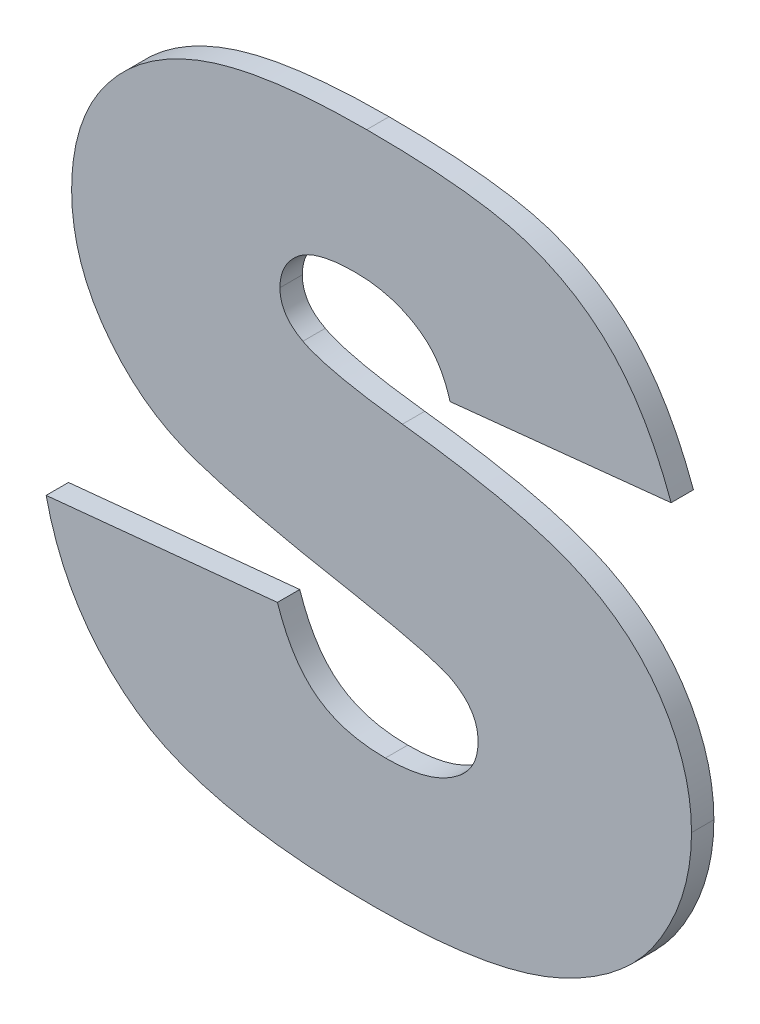
ISO-10303-21;
HEADER;
FILE_DESCRIPTION(('STEP AP214'),'2;1');
FILE_NAME('part.step','',(''),(''),'','','');
FILE_SCHEMA(('AUTOMOTIVE_DESIGN { 1 0 10303 214 1 1 1 1 }'));
ENDSEC;
DATA;
#1=APPLICATION_CONTEXT('core data for automotive mechanical design processes');
#2=APPLICATION_PROTOCOL_DEFINITION('international standard','automotive_design',2000,#1);
#3=PRODUCT_CONTEXT('',#1,'mechanical');
#4=PRODUCT('Part','Part','',(#3));
#5=PRODUCT_RELATED_PRODUCT_CATEGORY('part','',(#4));
#6=PRODUCT_DEFINITION_FORMATION('','',#4);
#7=PRODUCT_DEFINITION_CONTEXT('part definition',#1,'design');
#8=PRODUCT_DEFINITION('design','',#6,#7);
#9=PRODUCT_DEFINITION_SHAPE('','',#8);
#10=(LENGTH_UNIT() NAMED_UNIT(*) SI_UNIT(.MILLI.,.METRE.));
#11=(NAMED_UNIT(*) PLANE_ANGLE_UNIT() SI_UNIT($,.RADIAN.));
#12=(NAMED_UNIT(*) SI_UNIT($,.STERADIAN.) SOLID_ANGLE_UNIT());
#13=UNCERTAINTY_MEASURE_WITH_UNIT(LENGTH_MEASURE(1.E-05),#10,'distance_accuracy_value','');
#14=(GEOMETRIC_REPRESENTATION_CONTEXT(3) GLOBAL_UNCERTAINTY_ASSIGNED_CONTEXT((#13)) GLOBAL_UNIT_ASSIGNED_CONTEXT((#10,
#11,#12)) REPRESENTATION_CONTEXT('',''));
#15=CARTESIAN_POINT('',(0.,0.,0.));
#16=DIRECTION('',(0.,0.,1.));
#17=DIRECTION('',(1.,0.,0.));
#18=AXIS2_PLACEMENT_3D('',#15,#16,#17);
#19=CARTESIAN_POINT('',(1.4082386184724,-0.657639850114445,0.));
#20=CARTESIAN_POINT('',(1.4082386184724,-0.657639850114445,0.003));
#21=CARTESIAN_POINT('',(1.4051576482176,-0.64919573373164,0.));
#22=CARTESIAN_POINT('',(1.4051576482176,-0.64919573373164,0.003));
#23=CARTESIAN_POINT('',(1.3959147518425,-0.639382306428921,0.));
#24=CARTESIAN_POINT('',(1.3959147518425,-0.639382306428921,0.003));
#25=CARTESIAN_POINT('',(1.3819933617311,-0.634703820839705,0.));
#26=CARTESIAN_POINT('',(1.3819933617311,-0.634703820839705,0.003));
#27=CARTESIAN_POINT('',(1.3673873389081,-0.634703796504277,0.));
#28=CARTESIAN_POINT('',(1.3673873389081,-0.634703796504277,0.003));
#29=B_SPLINE_SURFACE_WITH_KNOTS('',2,1,((#19,#20),(#21,#22),(#23,#24),(#25,#26),(#27,#28)),
.UNSPECIFIED.,.F.,.F.,.F.,(3,1,1,3),(2,2),(-3.,-2.,-1.,0.),(0.,0.0003),.UNSPECIFIED.);
#30=CARTESIAN_POINT('',(1.4082386184724,-0.657639850114445,0.));
#31=CARTESIAN_POINT('',(1.4051576482176,-0.64919573373164,0.));
#32=CARTESIAN_POINT('',(1.3959147518425,-0.639382306428921,0.));
#33=CARTESIAN_POINT('',(1.3819933617311,-0.634703820839705,0.));
#34=CARTESIAN_POINT('',(1.3673873389081,-0.634703796504277,0.));
#35=B_SPLINE_CURVE_WITH_KNOTS('',2,(#30,#31,#32,#33,#34),.UNSPECIFIED.,.F.,.F.,(3,1,1,3),(-3.,
-2.,-1.,0.),.UNSPECIFIED.);
#36=CARTESIAN_POINT('',(1.4082386184724,-0.657639850114445,0.));
#37=VERTEX_POINT('',#36);
#38=CARTESIAN_POINT('',(1.3673873389081,-0.634703796504277,0.));
#39=VERTEX_POINT('',#38);
#40=EDGE_CURVE('E11',#37,#39,#35,.T.);
#41=DIRECTION('',(0.,0.,1.));
#42=VECTOR('',#41,1.);
#43=CARTESIAN_POINT('',(1.3673873389081,-0.634703796504277,0.));
#44=LINE('',#43,#42);
#45=CARTESIAN_POINT('',(1.3673873389081,-0.634703796504277,0.003));
#46=VERTEX_POINT('',#45);
#47=EDGE_CURVE('E28',#39,#46,#44,.T.);
#48=CARTESIAN_POINT('',(1.4082386184724,-0.657639850114445,0.003));
#49=CARTESIAN_POINT('',(1.4051576482176,-0.64919573373164,0.003));
#50=CARTESIAN_POINT('',(1.3959147518425,-0.639382306428921,0.003));
#51=CARTESIAN_POINT('',(1.3819933617311,-0.634703820839705,0.003));
#52=CARTESIAN_POINT('',(1.3673873389081,-0.634703796504277,0.003));
#53=B_SPLINE_CURVE_WITH_KNOTS('',2,(#48,#49,#50,#51,#52),.UNSPECIFIED.,.F.,.F.,(3,1,1,3),(-3.,
-2.,-1.,0.),.UNSPECIFIED.);
#54=CARTESIAN_POINT('',(1.4082386184724,-0.657639850114445,0.003));
#55=VERTEX_POINT('',#54);
#56=EDGE_CURVE('E164',#55,#46,#53,.T.);
#57=DIRECTION('',(0.,0.,1.));
#58=VECTOR('',#57,1.);
#59=CARTESIAN_POINT('',(1.4082386184724,-0.657639850114445,0.));
#60=LINE('',#59,#58);
#61=EDGE_CURVE('E450',#37,#55,#60,.T.);
#62=ORIENTED_EDGE('',*,*,#40,.T.);
#63=ORIENTED_EDGE('',*,*,#47,.T.);
#64=ORIENTED_EDGE('',*,*,#56,.F.);
#65=ORIENTED_EDGE('',*,*,#61,.F.);
#66=EDGE_LOOP('',(#62,#63,#64,#65));
#67=FACE_BOUND('',#66,.T.);
#68=ADVANCED_FACE('F17',(#67),#29,.T.);
#69=CARTESIAN_POINT('',(1.3785700914145,-0.660720812539698,0.));
#70=DIRECTION('',(0.103290702639445,-0.994651210600103,0.));
#71=DIRECTION('',(0.994651210600103,0.103290702639445,0.));
#72=AXIS2_PLACEMENT_3D('',#69,#70,#71);
#73=PLANE('',#72);
#74=DIRECTION('',(0.994651210600103,0.103290702639445,0.));
#75=VECTOR('',#74,1.);
#76=CARTESIAN_POINT('',(1.3785700914145,-0.660720812539698,0.));
#77=LINE('',#76,#75);
#78=CARTESIAN_POINT('',(1.3785700914145,-0.660720812539698,0.));
#79=VERTEX_POINT('',#78);
#80=EDGE_CURVE('E447',#79,#37,#77,.T.);
#81=ORIENTED_EDGE('',*,*,#80,.T.);
#82=ORIENTED_EDGE('',*,*,#61,.T.);
#83=DIRECTION('',(0.994651210600103,0.103290702639445,0.));
#84=VECTOR('',#83,1.);
#85=CARTESIAN_POINT('',(1.3785700914145,-0.660720812539698,0.003));
#86=LINE('',#85,#84);
#87=CARTESIAN_POINT('',(1.3785700914145,-0.660720812539698,0.003));
#88=VERTEX_POINT('',#87);
#89=EDGE_CURVE('E445',#88,#55,#86,.T.);
#90=ORIENTED_EDGE('',*,*,#89,.F.);
#91=DIRECTION('',(0.,0.,1.));
#92=VECTOR('',#91,1.);
#93=CARTESIAN_POINT('',(1.3785700914145,-0.660720812539698,0.));
#94=LINE('',#93,#92);
#95=EDGE_CURVE('E439',#79,#88,#94,.T.);
#96=ORIENTED_EDGE('',*,*,#95,.F.);
#97=EDGE_LOOP('',(#81,#82,#90,#96));
#98=FACE_BOUND('',#97,.T.);
#99=ADVANCED_FACE('F502',(#98),#73,.T.);
#100=CARTESIAN_POINT('',(1.3746903609531,-0.654672997408655,0.));
#101=CARTESIAN_POINT('',(1.3746903609531,-0.654672997408655,0.003));
#102=CARTESIAN_POINT('',(1.3774289942489,-0.656612862598566,0.));
#103=CARTESIAN_POINT('',(1.3774289942489,-0.656612862598566,0.003));
#104=CARTESIAN_POINT('',(1.3785700914145,-0.660720812539698,0.));
#105=CARTESIAN_POINT('',(1.3785700914145,-0.660720812539698,0.003));
#106=B_SPLINE_SURFACE_WITH_KNOTS('',2,1,((#100,#101),(#102,#103),(#104,#105)),.UNSPECIFIED.,.F.,
.F.,.F.,(3,3),(2,2),(-1.,0.),(0.,0.0003),.UNSPECIFIED.);
#107=CARTESIAN_POINT('',(1.3746903609531,-0.654672997408655,0.));
#108=CARTESIAN_POINT('',(1.3774289942489,-0.656612862598566,0.));
#109=CARTESIAN_POINT('',(1.3785700914145,-0.660720812539698,0.));
#110=B_SPLINE_CURVE_WITH_KNOTS('',2,(#107,#108,#109),.UNSPECIFIED.,.F.,.F.,(3,3),(-1.,0.),.UNSPECIFIED.);
#111=CARTESIAN_POINT('',(1.3746903609531,-0.654672997408655,0.));
#112=VERTEX_POINT('',#111);
#113=EDGE_CURVE('E431',#112,#79,#110,.T.);
#114=CARTESIAN_POINT('',(1.3746903609531,-0.654672997408655,0.003));
#115=CARTESIAN_POINT('',(1.3774289942489,-0.656612862598566,0.003));
#116=CARTESIAN_POINT('',(1.3785700914145,-0.660720812539698,0.003));
#117=B_SPLINE_CURVE_WITH_KNOTS('',2,(#114,#115,#116),.UNSPECIFIED.,.F.,.F.,(3,3),(-1.,0.),.UNSPECIFIED.);
#118=CARTESIAN_POINT('',(1.3746903609531,-0.654672997408655,0.003));
#119=VERTEX_POINT('',#118);
#120=EDGE_CURVE('E426',#119,#88,#117,.T.);
#121=DIRECTION('',(0.,0.,1.));
#122=VECTOR('',#121,1.);
#123=CARTESIAN_POINT('',(1.3746903609531,-0.654672997408655,0.));
#124=LINE('',#123,#122);
#125=EDGE_CURVE('E420',#112,#119,#124,.T.);
#126=ORIENTED_EDGE('',*,*,#113,.T.);
#127=ORIENTED_EDGE('',*,*,#95,.T.);
#128=ORIENTED_EDGE('',*,*,#120,.F.);
#129=ORIENTED_EDGE('',*,*,#125,.F.);
#130=EDGE_LOOP('',(#126,#127,#128,#129));
#131=FACE_BOUND('',#130,.T.);
#132=ADVANCED_FACE('F499',(#131),#106,.T.);
#133=CARTESIAN_POINT('',(1.3659039125552,-0.652048473861224,0.));
#134=CARTESIAN_POINT('',(1.3659039125552,-0.652048473861224,0.003));
#135=CARTESIAN_POINT('',(1.3710388499305,-0.652048450704146,0.));
#136=CARTESIAN_POINT('',(1.3710388499305,-0.652048450704146,0.003));
#137=CARTESIAN_POINT('',(1.3746903609531,-0.654672997408655,0.));
#138=CARTESIAN_POINT('',(1.3746903609531,-0.654672997408655,0.003));
#139=B_SPLINE_SURFACE_WITH_KNOTS('',2,1,((#133,#134),(#135,#136),(#137,#138)),.UNSPECIFIED.,.F.,
.F.,.F.,(3,3),(2,2),(-1.,0.),(0.,0.0003),.UNSPECIFIED.);
#140=CARTESIAN_POINT('',(1.3659039125552,-0.652048473861224,0.));
#141=CARTESIAN_POINT('',(1.3710388499305,-0.652048450704146,0.));
#142=CARTESIAN_POINT('',(1.3746903609531,-0.654672997408655,0.));
#143=B_SPLINE_CURVE_WITH_KNOTS('',2,(#140,#141,#142),.UNSPECIFIED.,.F.,.F.,(3,3),(-1.,0.),.UNSPECIFIED.);
#144=CARTESIAN_POINT('',(1.3659039125552,-0.652048473861224,0.));
#145=VERTEX_POINT('',#144);
#146=EDGE_CURVE('E412',#145,#112,#143,.T.);
#147=CARTESIAN_POINT('',(1.3659039125552,-0.652048473861224,0.003));
#148=CARTESIAN_POINT('',(1.3710388499305,-0.652048450704146,0.003));
#149=CARTESIAN_POINT('',(1.3746903609531,-0.654672997408655,0.003));
#150=B_SPLINE_CURVE_WITH_KNOTS('',2,(#147,#148,#149),.UNSPECIFIED.,.F.,.F.,(3,3),(-1.,0.),.UNSPECIFIED.);
#151=CARTESIAN_POINT('',(1.3659039125552,-0.652048473861224,0.003));
#152=VERTEX_POINT('',#151);
#153=EDGE_CURVE('E407',#152,#119,#150,.T.);
#154=DIRECTION('',(0.,0.,1.));
#155=VECTOR('',#154,1.);
#156=CARTESIAN_POINT('',(1.3659039125552,-0.652048473861224,0.));
#157=LINE('',#156,#155);
#158=EDGE_CURVE('E401',#145,#152,#157,.T.);
#159=ORIENTED_EDGE('',*,*,#146,.T.);
#160=ORIENTED_EDGE('',*,*,#125,.T.);
#161=ORIENTED_EDGE('',*,*,#153,.F.);
#162=ORIENTED_EDGE('',*,*,#158,.F.);
#163=EDGE_LOOP('',(#159,#160,#161,#162));
#164=FACE_BOUND('',#163,.T.);
#165=ADVANCED_FACE('F496',(#164),#139,.T.);
#166=CARTESIAN_POINT('',(1.3557481475238,-0.65889505702844,0.));
#167=CARTESIAN_POINT('',(1.3557481475238,-0.65889505702844,0.003));
#168=CARTESIAN_POINT('',(1.3557481369992,-0.656042314042115,0.));
#169=CARTESIAN_POINT('',(1.3557481369992,-0.656042314042115,0.003));
#170=CARTESIAN_POINT('',(1.3605407304816,-0.652048456179835,0.));
#171=CARTESIAN_POINT('',(1.3605407304816,-0.652048456179835,0.003));
#172=CARTESIAN_POINT('',(1.3659039125552,-0.652048473861224,0.));
#173=CARTESIAN_POINT('',(1.3659039125552,-0.652048473861224,0.003));
#174=B_SPLINE_SURFACE_WITH_KNOTS('',2,1,((#166,#167),(#168,#169),(#170,#171),(#172,#173)),
.UNSPECIFIED.,.F.,.F.,.F.,(3,1,3),(2,2),(-2.,-1.,0.),(0.,0.0003),.UNSPECIFIED.);
#175=CARTESIAN_POINT('',(1.3557481475238,-0.65889505702844,0.));
#176=CARTESIAN_POINT('',(1.3557481369992,-0.656042314042115,0.));
#177=CARTESIAN_POINT('',(1.3605407304816,-0.652048456179835,0.));
#178=CARTESIAN_POINT('',(1.3659039125552,-0.652048473861224,0.));
#179=B_SPLINE_CURVE_WITH_KNOTS('',2,(#175,#176,#177,#178),.UNSPECIFIED.,.F.,.F.,(3,1,3),(-2.,
-1.,0.),.UNSPECIFIED.);
#180=CARTESIAN_POINT('',(1.3557481475238,-0.65889505702844,0.));
#181=VERTEX_POINT('',#180);
#182=EDGE_CURVE('E393',#181,#145,#179,.T.);
#183=CARTESIAN_POINT('',(1.3557481475238,-0.65889505702844,0.003));
#184=CARTESIAN_POINT('',(1.3557481369992,-0.656042314042115,0.003));
#185=CARTESIAN_POINT('',(1.3605407304816,-0.652048456179835,0.003));
#186=CARTESIAN_POINT('',(1.3659039125552,-0.652048473861224,0.003));
#187=B_SPLINE_CURVE_WITH_KNOTS('',2,(#183,#184,#185,#186),.UNSPECIFIED.,.F.,.F.,(3,1,3),(-2.,
-1.,0.),.UNSPECIFIED.);
#188=CARTESIAN_POINT('',(1.3557481475238,-0.65889505702844,0.003));
#189=VERTEX_POINT('',#188);
#190=EDGE_CURVE('E388',#189,#152,#187,.T.);
#191=DIRECTION('',(0.,0.,1.));
#192=VECTOR('',#191,1.);
#193=CARTESIAN_POINT('',(1.3557481475238,-0.65889505702844,0.));
#194=LINE('',#193,#192);
#195=EDGE_CURVE('E382',#181,#189,#194,.T.);
#196=ORIENTED_EDGE('',*,*,#182,.T.);
#197=ORIENTED_EDGE('',*,*,#158,.T.);
#198=ORIENTED_EDGE('',*,*,#190,.F.);
#199=ORIENTED_EDGE('',*,*,#195,.F.);
#200=EDGE_LOOP('',(#196,#197,#198,#199));
#201=FACE_BOUND('',#200,.T.);
#202=ADVANCED_FACE('F493',(#201),#174,.T.);
#203=CARTESIAN_POINT('',(1.358829109949,-0.663573555526033,0.));
#204=CARTESIAN_POINT('',(1.358829109949,-0.663573555526033,0.003));
#205=CARTESIAN_POINT('',(1.3557481435751,-0.661976027069107,0.));
#206=CARTESIAN_POINT('',(1.3557481435751,-0.661976027069107,0.003));
#207=CARTESIAN_POINT('',(1.3557481475238,-0.65889505702844,0.));
#208=CARTESIAN_POINT('',(1.3557481475238,-0.65889505702844,0.003));
#209=B_SPLINE_SURFACE_WITH_KNOTS('',2,1,((#203,#204),(#205,#206),(#207,#208)),.UNSPECIFIED.,.F.,
.F.,.F.,(3,3),(2,2),(-1.,0.),(0.,0.0003),.UNSPECIFIED.);
#210=CARTESIAN_POINT('',(1.358829109949,-0.663573555526033,0.));
#211=CARTESIAN_POINT('',(1.3557481435751,-0.661976027069107,0.));
#212=CARTESIAN_POINT('',(1.3557481475238,-0.65889505702844,0.));
#213=B_SPLINE_CURVE_WITH_KNOTS('',2,(#210,#211,#212),.UNSPECIFIED.,.F.,.F.,(3,3),(-1.,0.),.UNSPECIFIED.);
#214=CARTESIAN_POINT('',(1.358829109949,-0.663573555526033,0.));
#215=VERTEX_POINT('',#214);
#216=EDGE_CURVE('E374',#215,#181,#213,.T.);
#217=CARTESIAN_POINT('',(1.358829109949,-0.663573555526033,0.003));
#218=CARTESIAN_POINT('',(1.3557481435751,-0.661976027069107,0.003));
#219=CARTESIAN_POINT('',(1.3557481475238,-0.65889505702844,0.003));
#220=B_SPLINE_CURVE_WITH_KNOTS('',2,(#217,#218,#219),.UNSPECIFIED.,.F.,.F.,(3,3),(-1.,0.),.UNSPECIFIED.);
#221=CARTESIAN_POINT('',(1.358829109949,-0.663573555526033,0.003));
#222=VERTEX_POINT('',#221);
#223=EDGE_CURVE('E369',#222,#189,#220,.T.);
#224=DIRECTION('',(0.,0.,1.));
#225=VECTOR('',#224,1.);
#226=CARTESIAN_POINT('',(1.358829109949,-0.663573555526033,0.));
#227=LINE('',#226,#225);
#228=EDGE_CURVE('E363',#215,#222,#227,.T.);
#229=ORIENTED_EDGE('',*,*,#216,.T.);
#230=ORIENTED_EDGE('',*,*,#195,.T.);
#231=ORIENTED_EDGE('',*,*,#223,.F.);
#232=ORIENTED_EDGE('',*,*,#228,.F.);
#233=EDGE_LOOP('',(#229,#230,#231,#232));
#234=FACE_BOUND('',#233,.T.);
#235=ADVANCED_FACE('F490',(#234),#209,.T.);
#236=CARTESIAN_POINT('',(1.3721799471251,-0.66654040823183,0.));
#237=CARTESIAN_POINT('',(1.3721799471251,-0.66654040823183,0.003));
#238=CARTESIAN_POINT('',(1.3619100710089,-0.665285212489224,0.));
#239=CARTESIAN_POINT('',(1.3619100710089,-0.665285212489224,0.003));
#240=CARTESIAN_POINT('',(1.358829109949,-0.663573555526033,0.));
#241=CARTESIAN_POINT('',(1.358829109949,-0.663573555526033,0.003));
#242=B_SPLINE_SURFACE_WITH_KNOTS('',2,1,((#236,#237),(#238,#239),(#240,#241)),.UNSPECIFIED.,.F.,
.F.,.F.,(3,3),(2,2),(-1.,0.),(0.,0.0003),.UNSPECIFIED.);
#243=CARTESIAN_POINT('',(1.3721799471251,-0.66654040823183,0.));
#244=CARTESIAN_POINT('',(1.3619100710089,-0.665285212489224,0.));
#245=CARTESIAN_POINT('',(1.358829109949,-0.663573555526033,0.));
#246=B_SPLINE_CURVE_WITH_KNOTS('',2,(#243,#244,#245),.UNSPECIFIED.,.F.,.F.,(3,3),(-1.,0.),.UNSPECIFIED.);
#247=CARTESIAN_POINT('',(1.3721799471251,-0.66654040823183,0.));
#248=VERTEX_POINT('',#247);
#249=EDGE_CURVE('E355',#248,#215,#246,.T.);
#250=CARTESIAN_POINT('',(1.3721799471251,-0.66654040823183,0.003));
#251=CARTESIAN_POINT('',(1.3619100710089,-0.665285212489224,0.003));
#252=CARTESIAN_POINT('',(1.358829109949,-0.663573555526033,0.003));
#253=B_SPLINE_CURVE_WITH_KNOTS('',2,(#250,#251,#252),.UNSPECIFIED.,.F.,.F.,(3,3),(-1.,0.),.UNSPECIFIED.);
#254=CARTESIAN_POINT('',(1.3721799471251,-0.66654040823183,0.003));
#255=VERTEX_POINT('',#254);
#256=EDGE_CURVE('E350',#255,#222,#253,.T.);
#257=DIRECTION('',(0.,0.,1.));
#258=VECTOR('',#257,1.);
#259=CARTESIAN_POINT('',(1.3721799471251,-0.66654040823183,0.));
#260=LINE('',#259,#258);
#261=EDGE_CURVE('E344',#248,#255,#260,.T.);
#262=ORIENTED_EDGE('',*,*,#249,.T.);
#263=ORIENTED_EDGE('',*,*,#228,.T.);
#264=ORIENTED_EDGE('',*,*,#256,.F.);
#265=ORIENTED_EDGE('',*,*,#261,.F.);
#266=EDGE_LOOP('',(#262,#263,#264,#265));
#267=FACE_BOUND('',#266,.T.);
#268=ADVANCED_FACE('F487',(#267),#242,.T.);
#269=CARTESIAN_POINT('',(1.4109772517393,-0.694611399217406,0.));
#270=CARTESIAN_POINT('',(1.4109772517393,-0.694611399217406,0.003));
#271=CARTESIAN_POINT('',(1.4109772428158,-0.687308377172382,0.));
#272=CARTESIAN_POINT('',(1.4109772428158,-0.687308377172382,0.003));
#273=CARTESIAN_POINT('',(1.4028754376761,-0.674984537370917,0.));
#274=CARTESIAN_POINT('',(1.4028754376761,-0.674984537370917,0.003));
#275=CARTESIAN_POINT('',(1.3876988369019,-0.668366192186816,0.));
#276=CARTESIAN_POINT('',(1.3876988369019,-0.668366192186816,0.003));
#277=CARTESIAN_POINT('',(1.3721799471251,-0.66654040823183,0.));
#278=CARTESIAN_POINT('',(1.3721799471251,-0.66654040823183,0.003));
#279=B_SPLINE_SURFACE_WITH_KNOTS('',2,1,((#269,#270),(#271,#272),(#273,#274),(#275,#276),(#277,
#278)),.UNSPECIFIED.,.F.,.F.,.F.,(3,1,1,3),(2,2),(-3.,-2.,-1.,0.),(0.,0.0003),.UNSPECIFIED.);
#280=CARTESIAN_POINT('',(1.4109772517393,-0.694611399217406,0.));
#281=CARTESIAN_POINT('',(1.4109772428158,-0.687308377172382,0.));
#282=CARTESIAN_POINT('',(1.4028754376761,-0.674984537370917,0.));
#283=CARTESIAN_POINT('',(1.3876988369019,-0.668366192186816,0.));
#284=CARTESIAN_POINT('',(1.3721799471251,-0.66654040823183,0.));
#285=B_SPLINE_CURVE_WITH_KNOTS('',2,(#280,#281,#282,#283,#284),.UNSPECIFIED.,.F.,.F.,(3,1,1,3),
(-3.,-2.,-1.,0.),.UNSPECIFIED.);
#286=CARTESIAN_POINT('',(1.4109772517393,-0.694611399217406,0.));
#287=VERTEX_POINT('',#286);
#288=EDGE_CURVE('E336',#287,#248,#285,.T.);
#289=CARTESIAN_POINT('',(1.4109772517393,-0.694611399217406,0.003));
#290=CARTESIAN_POINT('',(1.4109772428158,-0.687308377172382,0.003));
#291=CARTESIAN_POINT('',(1.4028754376761,-0.674984537370917,0.003));
#292=CARTESIAN_POINT('',(1.3876988369019,-0.668366192186816,0.003));
#293=CARTESIAN_POINT('',(1.3721799471251,-0.66654040823183,0.003));
#294=B_SPLINE_CURVE_WITH_KNOTS('',2,(#289,#290,#291,#292,#293),.UNSPECIFIED.,.F.,.F.,(3,1,1,3),
(-3.,-2.,-1.,0.),.UNSPECIFIED.);
#295=CARTESIAN_POINT('',(1.4109772517393,-0.694611399217406,0.003));
#296=VERTEX_POINT('',#295);
#297=EDGE_CURVE('E331',#296,#255,#294,.T.);
#298=DIRECTION('',(0.,0.,1.));
#299=VECTOR('',#298,1.);
#300=CARTESIAN_POINT('',(1.4109772517393,-0.694611399217406,0.));
#301=LINE('',#300,#299);
#302=EDGE_CURVE('E325',#287,#296,#301,.T.);
#303=ORIENTED_EDGE('',*,*,#288,.T.);
#304=ORIENTED_EDGE('',*,*,#261,.T.);
#305=ORIENTED_EDGE('',*,*,#297,.F.);
#306=ORIENTED_EDGE('',*,*,#302,.F.);
#307=EDGE_LOOP('',(#303,#304,#305,#306));
#308=FACE_BOUND('',#307,.T.);
#309=ADVANCED_FACE('F484',(#308),#279,.T.);
#310=CARTESIAN_POINT('',(1.3683002166637,-0.724508145714247,0.));
#311=CARTESIAN_POINT('',(1.3683002166637,-0.724508145714247,0.003));
#312=CARTESIAN_POINT('',(1.3841614676677,-0.72450814547791,0.));
#313=CARTESIAN_POINT('',(1.3841614676677,-0.72450814547791,0.003));
#314=CARTESIAN_POINT('',(1.4024190226562,-0.716178135685756,0.));
#315=CARTESIAN_POINT('',(1.4024190226562,-0.716178135685756,0.003));
#316=CARTESIAN_POINT('',(1.4109772514061,-0.702142640065437,0.));
#317=CARTESIAN_POINT('',(1.4109772514061,-0.702142640065437,0.003));
#318=CARTESIAN_POINT('',(1.4109772517393,-0.694611399217406,0.));
#319=CARTESIAN_POINT('',(1.4109772517393,-0.694611399217406,0.003));
#320=B_SPLINE_SURFACE_WITH_KNOTS('',2,1,((#310,#311),(#312,#313),(#314,#315),(#316,#317),(#318,
#319)),.UNSPECIFIED.,.F.,.F.,.F.,(3,1,1,3),(2,2),(-3.,-2.,-1.,0.),(0.,0.0003),.UNSPECIFIED.);
#321=CARTESIAN_POINT('',(1.3683002166637,-0.724508145714247,0.));
#322=CARTESIAN_POINT('',(1.3841614676677,-0.72450814547791,0.));
#323=CARTESIAN_POINT('',(1.4024190226562,-0.716178135685756,0.));
#324=CARTESIAN_POINT('',(1.4109772514061,-0.702142640065437,0.));
#325=CARTESIAN_POINT('',(1.4109772517393,-0.694611399217406,0.));
#326=B_SPLINE_CURVE_WITH_KNOTS('',2,(#321,#322,#323,#324,#325),.UNSPECIFIED.,.F.,.F.,(3,1,1,3),
(-3.,-2.,-1.,0.),.UNSPECIFIED.);
#327=CARTESIAN_POINT('',(1.3683002166637,-0.724508145714247,0.));
#328=VERTEX_POINT('',#327);
#329=EDGE_CURVE('E317',#328,#287,#326,.T.);
#330=CARTESIAN_POINT('',(1.3683002166637,-0.724508145714247,0.003));
#331=CARTESIAN_POINT('',(1.3841614676677,-0.72450814547791,0.003));
#332=CARTESIAN_POINT('',(1.4024190226562,-0.716178135685756,0.003));
#333=CARTESIAN_POINT('',(1.4109772514061,-0.702142640065437,0.003));
#334=CARTESIAN_POINT('',(1.4109772517393,-0.694611399217406,0.003));
#335=B_SPLINE_CURVE_WITH_KNOTS('',2,(#330,#331,#332,#333,#334),.UNSPECIFIED.,.F.,.F.,(3,1,1,3),
(-3.,-2.,-1.,0.),.UNSPECIFIED.);
#336=CARTESIAN_POINT('',(1.3683002166637,-0.724508145714247,0.003));
#337=VERTEX_POINT('',#336);
#338=EDGE_CURVE('E312',#337,#296,#335,.T.);
#339=DIRECTION('',(0.,0.,1.));
#340=VECTOR('',#339,1.);
#341=CARTESIAN_POINT('',(1.3683002166637,-0.724508145714247,0.));
#342=LINE('',#341,#340);
#343=EDGE_CURVE('E306',#328,#337,#342,.T.);
#344=ORIENTED_EDGE('',*,*,#329,.T.);
#345=ORIENTED_EDGE('',*,*,#302,.T.);
#346=ORIENTED_EDGE('',*,*,#338,.F.);
#347=ORIENTED_EDGE('',*,*,#343,.F.);
#348=EDGE_LOOP('',(#344,#345,#346,#347));
#349=FACE_BOUND('',#348,.T.);
#350=ADVANCED_FACE('F481',(#349),#320,.T.);
#351=CARTESIAN_POINT('',(1.3243679746741,-0.698719349117736,0.));
#352=CARTESIAN_POINT('',(1.3243679746741,-0.698719349117736,0.003));
#353=CARTESIAN_POINT('',(1.3271066226321,-0.711043195554043,0.));
#354=CARTESIAN_POINT('',(1.3271066226321,-0.711043195554043,0.003));
#355=CARTESIAN_POINT('',(1.3460488521128,-0.724508119868673,0.));
#356=CARTESIAN_POINT('',(1.3460488521128,-0.724508119868673,0.003));
#357=CARTESIAN_POINT('',(1.3683002166637,-0.724508145714247,0.));
#358=CARTESIAN_POINT('',(1.3683002166637,-0.724508145714247,0.003));
#359=B_SPLINE_SURFACE_WITH_KNOTS('',2,1,((#351,#352),(#353,#354),(#355,#356),(#357,#358)),
.UNSPECIFIED.,.F.,.F.,.F.,(3,1,3),(2,2),(-2.,-1.,0.),(0.,0.0003),.UNSPECIFIED.);
#360=CARTESIAN_POINT('',(1.3243679746741,-0.698719349117736,0.));
#361=CARTESIAN_POINT('',(1.3271066226321,-0.711043195554043,0.));
#362=CARTESIAN_POINT('',(1.3460488521128,-0.724508119868673,0.));
#363=CARTESIAN_POINT('',(1.3683002166637,-0.724508145714247,0.));
#364=B_SPLINE_CURVE_WITH_KNOTS('',2,(#360,#361,#362,#363),.UNSPECIFIED.,.F.,.F.,(3,1,3),(-2.,
-1.,0.),.UNSPECIFIED.);
#365=CARTESIAN_POINT('',(1.3243679746741,-0.698719349117736,0.));
#366=VERTEX_POINT('',#365);
#367=EDGE_CURVE('E298',#366,#328,#364,.T.);
#368=CARTESIAN_POINT('',(1.3243679746741,-0.698719349117736,0.003));
#369=CARTESIAN_POINT('',(1.3271066226321,-0.711043195554043,0.003));
#370=CARTESIAN_POINT('',(1.3460488521128,-0.724508119868673,0.003));
#371=CARTESIAN_POINT('',(1.3683002166637,-0.724508145714247,0.003));
#372=B_SPLINE_CURVE_WITH_KNOTS('',2,(#368,#369,#370,#371),.UNSPECIFIED.,.F.,.F.,(3,1,3),(-2.,
-1.,0.),.UNSPECIFIED.);
#373=CARTESIAN_POINT('',(1.3243679746741,-0.698719349117736,0.003));
#374=VERTEX_POINT('',#373);
#375=EDGE_CURVE('E293',#374,#337,#372,.T.);
#376=DIRECTION('',(0.,0.,1.));
#377=VECTOR('',#376,1.);
#378=CARTESIAN_POINT('',(1.3243679746741,-0.698719349117736,0.));
#379=LINE('',#378,#377);
#380=EDGE_CURVE('E290',#366,#374,#379,.T.);
#381=ORIENTED_EDGE('',*,*,#367,.T.);
#382=ORIENTED_EDGE('',*,*,#343,.T.);
#383=ORIENTED_EDGE('',*,*,#375,.F.);
#384=ORIENTED_EDGE('',*,*,#380,.F.);
#385=EDGE_LOOP('',(#381,#382,#383,#384));
#386=FACE_BOUND('',#385,.T.);
#387=ADVANCED_FACE('F478',(#386),#359,.T.);
#388=CARTESIAN_POINT('',(1.3554058183654,-0.69563838669249,0.));
#389=DIRECTION('',(-0.0987792391162036,0.995109371837902,0.));
#390=DIRECTION('',(-0.995109371837902,-0.0987792391162036,0.));
#391=AXIS2_PLACEMENT_3D('',#388,#389,#390);
#392=PLANE('',#391);
#393=DIRECTION('',(-0.995109371837902,-0.0987792391162036,0.));
#394=VECTOR('',#393,1.);
#395=CARTESIAN_POINT('',(1.3554058183654,-0.69563838669249,0.));
#396=LINE('',#395,#394);
#397=CARTESIAN_POINT('',(1.3554058183654,-0.69563838669249,0.));
#398=VERTEX_POINT('',#397);
#399=EDGE_CURVE('E287',#398,#366,#396,.T.);
#400=ORIENTED_EDGE('',*,*,#399,.T.);
#401=ORIENTED_EDGE('',*,*,#380,.T.);
#402=DIRECTION('',(-0.995109371837902,-0.0987792391162036,0.));
#403=VECTOR('',#402,1.);
#404=CARTESIAN_POINT('',(1.3554058183654,-0.69563838669249,0.003));
#405=LINE('',#404,#403);
#406=CARTESIAN_POINT('',(1.3554058183654,-0.69563838669249,0.003));
#407=VERTEX_POINT('',#406);
#408=EDGE_CURVE('E284',#407,#374,#405,.T.);
#409=ORIENTED_EDGE('',*,*,#408,.F.);
#410=DIRECTION('',(0.,0.,1.));
#411=VECTOR('',#410,1.);
#412=CARTESIAN_POINT('',(1.3554058183654,-0.69563838669249,0.));
#413=LINE('',#412,#411);
#414=EDGE_CURVE('E278',#398,#407,#413,.T.);
#415=ORIENTED_EDGE('',*,*,#414,.F.);
#416=EDGE_LOOP('',(#400,#401,#409,#415));
#417=FACE_BOUND('',#416,.T.);
#418=ADVANCED_FACE('F475',(#417),#392,.T.);
#419=CARTESIAN_POINT('',(1.369897752736,-0.706478810040581,0.));
#420=CARTESIAN_POINT('',(1.369897752736,-0.706478810040581,0.003));
#421=CARTESIAN_POINT('',(1.3641922667633,-0.706478816842037,0.));
#422=CARTESIAN_POINT('',(1.3641922667633,-0.706478816842037,0.003));
#423=CARTESIAN_POINT('',(1.3573456776109,-0.701457997347848,0.));
#424=CARTESIAN_POINT('',(1.3573456776109,-0.701457997347848,0.003));
#425=CARTESIAN_POINT('',(1.3554058183654,-0.69563838669249,0.));
#426=CARTESIAN_POINT('',(1.3554058183654,-0.69563838669249,0.003));
#427=B_SPLINE_SURFACE_WITH_KNOTS('',2,1,((#419,#420),(#421,#422),(#423,#424),(#425,#426)),
.UNSPECIFIED.,.F.,.F.,.F.,(3,1,3),(2,2),(-2.,-1.,0.),(0.,0.0003),.UNSPECIFIED.);
#428=CARTESIAN_POINT('',(1.369897752736,-0.706478810040581,0.));
#429=CARTESIAN_POINT('',(1.3641922667633,-0.706478816842037,0.));
#430=CARTESIAN_POINT('',(1.3573456776109,-0.701457997347848,0.));
#431=CARTESIAN_POINT('',(1.3554058183654,-0.69563838669249,0.));
#432=B_SPLINE_CURVE_WITH_KNOTS('',2,(#428,#429,#430,#431),.UNSPECIFIED.,.F.,.F.,(3,1,3),(-2.,
-1.,0.),.UNSPECIFIED.);
#433=CARTESIAN_POINT('',(1.369897752736,-0.706478810040581,0.));
#434=VERTEX_POINT('',#433);
#435=EDGE_CURVE('E270',#434,#398,#432,.T.);
#436=CARTESIAN_POINT('',(1.369897752736,-0.706478810040581,0.003));
#437=CARTESIAN_POINT('',(1.3641922667633,-0.706478816842037,0.003));
#438=CARTESIAN_POINT('',(1.3573456776109,-0.701457997347848,0.003));
#439=CARTESIAN_POINT('',(1.3554058183654,-0.69563838669249,0.003));
#440=B_SPLINE_CURVE_WITH_KNOTS('',2,(#436,#437,#438,#439),.UNSPECIFIED.,.F.,.F.,(3,1,3),(-2.,
-1.,0.),.UNSPECIFIED.);
#441=CARTESIAN_POINT('',(1.369897752736,-0.706478810040581,0.003));
#442=VERTEX_POINT('',#441);
#443=EDGE_CURVE('E265',#442,#407,#440,.T.);
#444=DIRECTION('',(0.,0.,1.));
#445=VECTOR('',#444,1.);
#446=CARTESIAN_POINT('',(1.369897752736,-0.706478810040581,0.));
#447=LINE('',#446,#445);
#448=EDGE_CURVE('E259',#434,#442,#447,.T.);
#449=ORIENTED_EDGE('',*,*,#435,.T.);
#450=ORIENTED_EDGE('',*,*,#414,.T.);
#451=ORIENTED_EDGE('',*,*,#443,.F.);
#452=ORIENTED_EDGE('',*,*,#448,.F.);
#453=EDGE_LOOP('',(#449,#450,#451,#452));
#454=FACE_BOUND('',#453,.T.);
#455=ADVANCED_FACE('F472',(#454),#427,.T.);
#456=CARTESIAN_POINT('',(1.379711188609,-0.703626067054239,0.));
#457=CARTESIAN_POINT('',(1.379711188609,-0.703626067054239,0.003));
#458=CARTESIAN_POINT('',(1.3761737889888,-0.706478812127178,0.));
#459=CARTESIAN_POINT('',(1.3761737889888,-0.706478812127178,0.003));
#460=CARTESIAN_POINT('',(1.369897752736,-0.706478810040581,0.));
#461=CARTESIAN_POINT('',(1.369897752736,-0.706478810040581,0.003));
#462=B_SPLINE_SURFACE_WITH_KNOTS('',2,1,((#456,#457),(#458,#459),(#460,#461)),.UNSPECIFIED.,.F.,
.F.,.F.,(3,3),(2,2),(-1.,0.),(0.,0.0003),.UNSPECIFIED.);
#463=CARTESIAN_POINT('',(1.379711188609,-0.703626067054239,0.));
#464=CARTESIAN_POINT('',(1.3761737889888,-0.706478812127178,0.));
#465=CARTESIAN_POINT('',(1.369897752736,-0.706478810040581,0.));
#466=B_SPLINE_CURVE_WITH_KNOTS('',2,(#463,#464,#465),.UNSPECIFIED.,.F.,.F.,(3,3),(-1.,0.),.UNSPECIFIED.);
#467=CARTESIAN_POINT('',(1.379711188609,-0.703626067054239,0.));
#468=VERTEX_POINT('',#467);
#469=EDGE_CURVE('E251',#468,#434,#466,.T.);
#470=CARTESIAN_POINT('',(1.379711188609,-0.703626067054239,0.003));
#471=CARTESIAN_POINT('',(1.3761737889888,-0.706478812127178,0.003));
#472=CARTESIAN_POINT('',(1.369897752736,-0.706478810040581,0.003));
#473=B_SPLINE_CURVE_WITH_KNOTS('',2,(#470,#471,#472),.UNSPECIFIED.,.F.,.F.,(3,3),(-1.,0.),.UNSPECIFIED.);
#474=CARTESIAN_POINT('',(1.379711188609,-0.703626067054239,0.003));
#475=VERTEX_POINT('',#474);
#476=EDGE_CURVE('E246',#475,#442,#473,.T.);
#477=DIRECTION('',(0.,0.,1.));
#478=VECTOR('',#477,1.);
#479=CARTESIAN_POINT('',(1.379711188609,-0.703626067054239,0.));
#480=LINE('',#479,#478);
#481=EDGE_CURVE('E240',#468,#475,#480,.T.);
#482=ORIENTED_EDGE('',*,*,#469,.T.);
#483=ORIENTED_EDGE('',*,*,#448,.T.);
#484=ORIENTED_EDGE('',*,*,#476,.F.);
#485=ORIENTED_EDGE('',*,*,#481,.F.);
#486=EDGE_LOOP('',(#482,#483,#484,#485));
#487=FACE_BOUND('',#486,.T.);
#488=ADVANCED_FACE('F469',(#487),#462,.T.);
#489=CARTESIAN_POINT('',(1.3823357121565,-0.698377019959377,0.));
#490=CARTESIAN_POINT('',(1.3823357121565,-0.698377019959377,0.003));
#491=CARTESIAN_POINT('',(1.3823357127278,-0.701572092104061,0.));
#492=CARTESIAN_POINT('',(1.3823357127278,-0.701572092104061,0.003));
#493=CARTESIAN_POINT('',(1.379711188609,-0.703626067054239,0.));
#494=CARTESIAN_POINT('',(1.379711188609,-0.703626067054239,0.003));
#495=B_SPLINE_SURFACE_WITH_KNOTS('',2,1,((#489,#490),(#491,#492),(#493,#494)),.UNSPECIFIED.,.F.,
.F.,.F.,(3,3),(2,2),(-1.,0.),(0.,0.0003),.UNSPECIFIED.);
#496=CARTESIAN_POINT('',(1.3823357121565,-0.698377019959377,0.));
#497=CARTESIAN_POINT('',(1.3823357127278,-0.701572092104061,0.));
#498=CARTESIAN_POINT('',(1.379711188609,-0.703626067054239,0.));
#499=B_SPLINE_CURVE_WITH_KNOTS('',2,(#496,#497,#498),.UNSPECIFIED.,.F.,.F.,(3,3),(-1.,0.),.UNSPECIFIED.);
#500=CARTESIAN_POINT('',(1.3823357121565,-0.698377019959377,0.));
#501=VERTEX_POINT('',#500);
#502=EDGE_CURVE('E232',#501,#468,#499,.T.);
#503=CARTESIAN_POINT('',(1.3823357121565,-0.698377019959377,0.003));
#504=CARTESIAN_POINT('',(1.3823357127278,-0.701572092104061,0.003));
#505=CARTESIAN_POINT('',(1.379711188609,-0.703626067054239,0.003));
#506=B_SPLINE_CURVE_WITH_KNOTS('',2,(#503,#504,#505),.UNSPECIFIED.,.F.,.F.,(3,3),(-1.,0.),.UNSPECIFIED.);
#507=CARTESIAN_POINT('',(1.3823357121565,-0.698377019959377,0.003));
#508=VERTEX_POINT('',#507);
#509=EDGE_CURVE('E227',#508,#475,#506,.T.);
#510=DIRECTION('',(0.,0.,1.));
#511=VECTOR('',#510,1.);
#512=CARTESIAN_POINT('',(1.3823357121565,-0.698377019959377,0.));
#513=LINE('',#512,#511);
#514=EDGE_CURVE('E221',#501,#508,#513,.T.);
#515=ORIENTED_EDGE('',*,*,#502,.T.);
#516=ORIENTED_EDGE('',*,*,#481,.T.);
#517=ORIENTED_EDGE('',*,*,#509,.F.);
#518=ORIENTED_EDGE('',*,*,#514,.F.);
#519=EDGE_LOOP('',(#515,#516,#517,#518));
#520=FACE_BOUND('',#519,.T.);
#521=ADVANCED_FACE('F466',(#520),#495,.T.);
#522=CARTESIAN_POINT('',(1.3787983108534,-0.692899753425604,0.));
#523=CARTESIAN_POINT('',(1.3787983108534,-0.692899753425604,0.003));
#524=CARTESIAN_POINT('',(1.3823357208547,-0.694839602794914,0.));
#525=CARTESIAN_POINT('',(1.3823357208547,-0.694839602794914,0.003));
#526=CARTESIAN_POINT('',(1.3823357121565,-0.698377019959377,0.));
#527=CARTESIAN_POINT('',(1.3823357121565,-0.698377019959377,0.003));
#528=B_SPLINE_SURFACE_WITH_KNOTS('',2,1,((#522,#523),(#524,#525),(#526,#527)),.UNSPECIFIED.,.F.,
.F.,.F.,(3,3),(2,2),(-1.,0.),(0.,0.0003),.UNSPECIFIED.);
#529=CARTESIAN_POINT('',(1.3787983108534,-0.692899753425604,0.));
#530=CARTESIAN_POINT('',(1.3823357208547,-0.694839602794914,0.));
#531=CARTESIAN_POINT('',(1.3823357121565,-0.698377019959377,0.));
#532=B_SPLINE_CURVE_WITH_KNOTS('',2,(#529,#530,#531),.UNSPECIFIED.,.F.,.F.,(3,3),(-1.,0.),.UNSPECIFIED.);
#533=CARTESIAN_POINT('',(1.3787983108534,-0.692899753425604,0.));
#534=VERTEX_POINT('',#533);
#535=EDGE_CURVE('E213',#534,#501,#532,.T.);
#536=CARTESIAN_POINT('',(1.3787983108534,-0.692899753425604,0.003));
#537=CARTESIAN_POINT('',(1.3823357208547,-0.694839602794914,0.003));
#538=CARTESIAN_POINT('',(1.3823357121565,-0.698377019959377,0.003));
#539=B_SPLINE_CURVE_WITH_KNOTS('',2,(#536,#537,#538),.UNSPECIFIED.,.F.,.F.,(3,3),(-1.,0.),.UNSPECIFIED.);
#540=CARTESIAN_POINT('',(1.3787983108534,-0.692899753425604,0.003));
#541=VERTEX_POINT('',#540);
#542=EDGE_CURVE('E208',#541,#508,#539,.T.);
#543=DIRECTION('',(0.,0.,1.));
#544=VECTOR('',#543,1.);
#545=CARTESIAN_POINT('',(1.3787983108534,-0.692899753425604,0.));
#546=LINE('',#545,#544);
#547=EDGE_CURVE('E202',#534,#541,#546,.T.);
#548=ORIENTED_EDGE('',*,*,#535,.T.);
#549=ORIENTED_EDGE('',*,*,#514,.T.);
#550=ORIENTED_EDGE('',*,*,#542,.F.);
#551=ORIENTED_EDGE('',*,*,#547,.F.);
#552=EDGE_LOOP('',(#548,#549,#550,#551));
#553=FACE_BOUND('',#552,.T.);
#554=ADVANCED_FACE('F463',(#553),#528,.T.);
#555=CARTESIAN_POINT('',(1.3654474736774,-0.689476461841999,0.));
#556=CARTESIAN_POINT('',(1.3654474736774,-0.689476461841999,0.003));
#557=CARTESIAN_POINT('',(1.376287901298,-0.691530414243028,0.));
#558=CARTESIAN_POINT('',(1.376287901298,-0.691530414243028,0.003));
#559=CARTESIAN_POINT('',(1.3787983108534,-0.692899753425604,0.));
#560=CARTESIAN_POINT('',(1.3787983108534,-0.692899753425604,0.003));
#561=B_SPLINE_SURFACE_WITH_KNOTS('',2,1,((#555,#556),(#557,#558),(#559,#560)),.UNSPECIFIED.,.F.,
.F.,.F.,(3,3),(2,2),(-1.,0.),(0.,0.0003),.UNSPECIFIED.);
#562=CARTESIAN_POINT('',(1.3654474736774,-0.689476461841999,0.));
#563=CARTESIAN_POINT('',(1.376287901298,-0.691530414243028,0.));
#564=CARTESIAN_POINT('',(1.3787983108534,-0.692899753425604,0.));
#565=B_SPLINE_CURVE_WITH_KNOTS('',2,(#562,#563,#564),.UNSPECIFIED.,.F.,.F.,(3,3),(-1.,0.),.UNSPECIFIED.);
#566=CARTESIAN_POINT('',(1.3654474736774,-0.689476461841999,0.));
#567=VERTEX_POINT('',#566);
#568=EDGE_CURVE('E194',#567,#534,#565,.T.);
#569=CARTESIAN_POINT('',(1.3654474736774,-0.689476461841999,0.003));
#570=CARTESIAN_POINT('',(1.376287901298,-0.691530414243028,0.003));
#571=CARTESIAN_POINT('',(1.3787983108534,-0.692899753425604,0.003));
#572=B_SPLINE_CURVE_WITH_KNOTS('',2,(#569,#570,#571),.UNSPECIFIED.,.F.,.F.,(3,3),(-1.,0.),.UNSPECIFIED.);
#573=CARTESIAN_POINT('',(1.3654474736774,-0.689476461841999,0.003));
#574=VERTEX_POINT('',#573);
#575=EDGE_CURVE('E190',#574,#541,#572,.T.);
#576=DIRECTION('',(0.,0.,1.));
#577=VECTOR('',#576,1.);
#578=CARTESIAN_POINT('',(1.3654474736774,-0.689476461841999,0.));
#579=LINE('',#578,#577);
#580=EDGE_CURVE('E149',#567,#574,#579,.T.);
#581=ORIENTED_EDGE('',*,*,#568,.T.);
#582=ORIENTED_EDGE('',*,*,#547,.T.);
#583=ORIENTED_EDGE('',*,*,#575,.F.);
#584=ORIENTED_EDGE('',*,*,#580,.F.);
#585=EDGE_LOOP('',(#581,#582,#583,#584));
#586=FACE_BOUND('',#585,.T.);
#587=ADVANCED_FACE('F461',(#586),#561,.T.);
#588=CARTESIAN_POINT('',(1.3277912662577,-0.661519580575872,0.));
#589=CARTESIAN_POINT('',(1.3277912662577,-0.661519580575872,0.003));
#590=CARTESIAN_POINT('',(1.3277913042306,-0.669279041498611,0.));
#591=CARTESIAN_POINT('',(1.3277913042306,-0.669279041498611,0.003));
#592=CARTESIAN_POINT('',(1.336463702102,-0.681374629320308,0.));
#593=CARTESIAN_POINT('',(1.336463702102,-0.681374629320308,0.003));
#594=CARTESIAN_POINT('',(1.3491299060902,-0.686509504710457,0.));
#595=CARTESIAN_POINT('',(1.3491299060902,-0.686509504710457,0.003));
#596=CARTESIAN_POINT('',(1.3654474736774,-0.689476461841999,0.));
#597=CARTESIAN_POINT('',(1.3654474736774,-0.689476461841999,0.003));
#598=B_SPLINE_SURFACE_WITH_KNOTS('',2,1,((#588,#589),(#590,#591),(#592,#593),(#594,#595),(#596,
#597)),.UNSPECIFIED.,.F.,.F.,.F.,(3,1,1,3),(2,2),(-3.,-2.,-1.,0.),(0.,0.0003),.UNSPECIFIED.);
#599=CARTESIAN_POINT('',(1.3277912662577,-0.661519580575872,0.));
#600=CARTESIAN_POINT('',(1.3277913042306,-0.669279041498611,0.));
#601=CARTESIAN_POINT('',(1.336463702102,-0.681374629320308,0.));
#602=CARTESIAN_POINT('',(1.3491299060902,-0.686509504710457,0.));
#603=CARTESIAN_POINT('',(1.3654474736774,-0.689476461841999,0.));
#604=B_SPLINE_CURVE_WITH_KNOTS('',2,(#599,#600,#601,#602,#603),.UNSPECIFIED.,.F.,.F.,(3,1,1,3),
(-3.,-2.,-1.,0.),.UNSPECIFIED.);
#605=CARTESIAN_POINT('',(1.3277912662577,-0.661519580575872,0.));
#606=VERTEX_POINT('',#605);
#607=EDGE_CURVE('E153',#606,#567,#604,.T.);
#608=CARTESIAN_POINT('',(1.3277912662577,-0.661519580575872,0.003));
#609=CARTESIAN_POINT('',(1.3277913042306,-0.669279041498611,0.003));
#610=CARTESIAN_POINT('',(1.336463702102,-0.681374629320308,0.003));
#611=CARTESIAN_POINT('',(1.3491299060902,-0.686509504710457,0.003));
#612=CARTESIAN_POINT('',(1.3654474736774,-0.689476461841999,0.003));
#613=B_SPLINE_CURVE_WITH_KNOTS('',2,(#608,#609,#610,#611,#612),.UNSPECIFIED.,.F.,.F.,(3,1,1,3),
(-3.,-2.,-1.,0.),.UNSPECIFIED.);
#614=CARTESIAN_POINT('',(1.3277912662577,-0.661519580575872,0.003));
#615=VERTEX_POINT('',#614);
#616=EDGE_CURVE('E142',#615,#574,#613,.T.);
#617=DIRECTION('',(0.,0.,1.));
#618=VECTOR('',#617,1.);
#619=CARTESIAN_POINT('',(1.3277912662577,-0.661519580575872,0.));
#620=LINE('',#619,#618);
#621=EDGE_CURVE('E146',#606,#615,#620,.T.);
#622=ORIENTED_EDGE('',*,*,#607,.T.);
#623=ORIENTED_EDGE('',*,*,#580,.T.);
#624=ORIENTED_EDGE('',*,*,#616,.F.);
#625=ORIENTED_EDGE('',*,*,#621,.F.);
#626=EDGE_LOOP('',(#622,#623,#624,#625));
#627=FACE_BOUND('',#626,.T.);
#628=ADVANCED_FACE('F145',(#627),#598,.T.);
#629=CARTESIAN_POINT('',(1.3673873389081,-0.634703796504277,0.));
#630=CARTESIAN_POINT('',(1.3673873389081,-0.634703796504277,0.003));
#631=CARTESIAN_POINT('',(1.3535800628542,-0.634703796504311,0.));
#632=CARTESIAN_POINT('',(1.3535800628542,-0.634703796504311,0.003));
#633=CARTESIAN_POINT('',(1.3371482632528,-0.640751611635296,0.));
#634=CARTESIAN_POINT('',(1.3371482632528,-0.640751611635296,0.003));
#635=CARTESIAN_POINT('',(1.3277912662577,-0.653075461336309,0.));
#636=CARTESIAN_POINT('',(1.3277912662577,-0.653075461336309,0.003));
#637=CARTESIAN_POINT('',(1.3277912662577,-0.661519580575872,0.));
#638=CARTESIAN_POINT('',(1.3277912662577,-0.661519580575872,0.003));
#639=B_SPLINE_SURFACE_WITH_KNOTS('',2,1,((#629,#630),(#631,#632),(#633,#634),(#635,#636),(#637,
#638)),.UNSPECIFIED.,.F.,.F.,.F.,(3,1,1,3),(2,2),(-3.,-2.,-1.,0.),(0.,0.0003),.UNSPECIFIED.);
#640=CARTESIAN_POINT('',(1.3673873389081,-0.634703796504277,0.));
#641=CARTESIAN_POINT('',(1.3535800628542,-0.634703796504311,0.));
#642=CARTESIAN_POINT('',(1.3371482632528,-0.640751611635296,0.));
#643=CARTESIAN_POINT('',(1.3277912662577,-0.653075461336309,0.));
#644=CARTESIAN_POINT('',(1.3277912662577,-0.661519580575872,0.));
#645=B_SPLINE_CURVE_WITH_KNOTS('',2,(#640,#641,#642,#643,#644),.UNSPECIFIED.,.F.,.F.,(3,1,1,3),
(-3.,-2.,-1.,0.),.UNSPECIFIED.);
#646=EDGE_CURVE('E159',#39,#606,#645,.T.);
#647=CARTESIAN_POINT('',(1.3673873389081,-0.634703796504277,0.003));
#648=CARTESIAN_POINT('',(1.3535800628542,-0.634703796504311,0.003));
#649=CARTESIAN_POINT('',(1.3371482632528,-0.640751611635296,0.003));
#650=CARTESIAN_POINT('',(1.3277912662577,-0.653075461336309,0.003));
#651=CARTESIAN_POINT('',(1.3277912662577,-0.661519580575872,0.003));
#652=B_SPLINE_CURVE_WITH_KNOTS('',2,(#647,#648,#649,#650,#651),.UNSPECIFIED.,.F.,.F.,(3,1,1,3),
(-3.,-2.,-1.,0.),.UNSPECIFIED.);
#653=EDGE_CURVE('E158',#46,#615,#652,.T.);
#654=ORIENTED_EDGE('',*,*,#646,.T.);
#655=ORIENTED_EDGE('',*,*,#621,.T.);
#656=ORIENTED_EDGE('',*,*,#653,.F.);
#657=ORIENTED_EDGE('',*,*,#47,.F.);
#658=EDGE_LOOP('',(#654,#655,#656,#657));
#659=FACE_BOUND('',#658,.T.);
#660=ADVANCED_FACE('F157',(#659),#639,.T.);
#661=CARTESIAN_POINT('',(1.3676726132067,-0.679605971109262,0.003));
#662=DIRECTION('',(0.,0.,1.));
#663=DIRECTION('',(1.,0.,0.));
#664=AXIS2_PLACEMENT_3D('',#661,#662,#663);
#665=PLANE('',#664);
#666=ORIENTED_EDGE('',*,*,#653,.T.);
#667=ORIENTED_EDGE('',*,*,#616,.T.);
#668=ORIENTED_EDGE('',*,*,#575,.T.);
#669=ORIENTED_EDGE('',*,*,#542,.T.);
#670=ORIENTED_EDGE('',*,*,#509,.T.);
#671=ORIENTED_EDGE('',*,*,#476,.T.);
#672=ORIENTED_EDGE('',*,*,#443,.T.);
#673=ORIENTED_EDGE('',*,*,#408,.T.);
#674=ORIENTED_EDGE('',*,*,#375,.T.);
#675=ORIENTED_EDGE('',*,*,#338,.T.);
#676=ORIENTED_EDGE('',*,*,#297,.T.);
#677=ORIENTED_EDGE('',*,*,#256,.T.);
#678=ORIENTED_EDGE('',*,*,#223,.T.);
#679=ORIENTED_EDGE('',*,*,#190,.T.);
#680=ORIENTED_EDGE('',*,*,#153,.T.);
#681=ORIENTED_EDGE('',*,*,#120,.T.);
#682=ORIENTED_EDGE('',*,*,#89,.T.);
#683=ORIENTED_EDGE('',*,*,#56,.T.);
#684=EDGE_LOOP('',(#666,#667,#668,#669,#670,#671,#672,#673,#674,#675,#676,#677,#678,#679,#680,
#681,#682,#683));
#685=FACE_BOUND('',#684,.T.);
#686=ADVANCED_FACE('F162',(#685),#665,.T.);
#687=CARTESIAN_POINT('',(1.3676726132067,-0.679605971109262,0.));
#688=DIRECTION('',(0.,0.,1.));
#689=DIRECTION('',(1.,0.,0.));
#690=AXIS2_PLACEMENT_3D('',#687,#688,#689);
#691=PLANE('',#690);
#692=ORIENTED_EDGE('',*,*,#646,.F.);
#693=ORIENTED_EDGE('',*,*,#40,.F.);
#694=ORIENTED_EDGE('',*,*,#80,.F.);
#695=ORIENTED_EDGE('',*,*,#113,.F.);
#696=ORIENTED_EDGE('',*,*,#146,.F.);
#697=ORIENTED_EDGE('',*,*,#182,.F.);
#698=ORIENTED_EDGE('',*,*,#216,.F.);
#699=ORIENTED_EDGE('',*,*,#249,.F.);
#700=ORIENTED_EDGE('',*,*,#288,.F.);
#701=ORIENTED_EDGE('',*,*,#329,.F.);
#702=ORIENTED_EDGE('',*,*,#367,.F.);
#703=ORIENTED_EDGE('',*,*,#399,.F.);
#704=ORIENTED_EDGE('',*,*,#435,.F.);
#705=ORIENTED_EDGE('',*,*,#469,.F.);
#706=ORIENTED_EDGE('',*,*,#502,.F.);
#707=ORIENTED_EDGE('',*,*,#535,.F.);
#708=ORIENTED_EDGE('',*,*,#568,.F.);
#709=ORIENTED_EDGE('',*,*,#607,.F.);
#710=EDGE_LOOP('',(#692,#693,#694,#695,#696,#697,#698,#699,#700,#701,#702,#703,#704,#705,#706,
#707,#708,#709));
#711=FACE_BOUND('',#710,.T.);
#712=ADVANCED_FACE('F458',(#711),#691,.F.);
#713=CLOSED_SHELL('',(#68,#99,#132,#165,#202,#235,#268,#309,#350,#387,#418,#455,#488,#521,#554,
#587,#628,#660,#686,#712));
#714=MANIFOLD_SOLID_BREP('B1',#713);
#715=ADVANCED_BREP_SHAPE_REPRESENTATION('',(#18,#714),#14);
#716=SHAPE_DEFINITION_REPRESENTATION(#9,#715);
ENDSEC;
END-ISO-10303-21;
